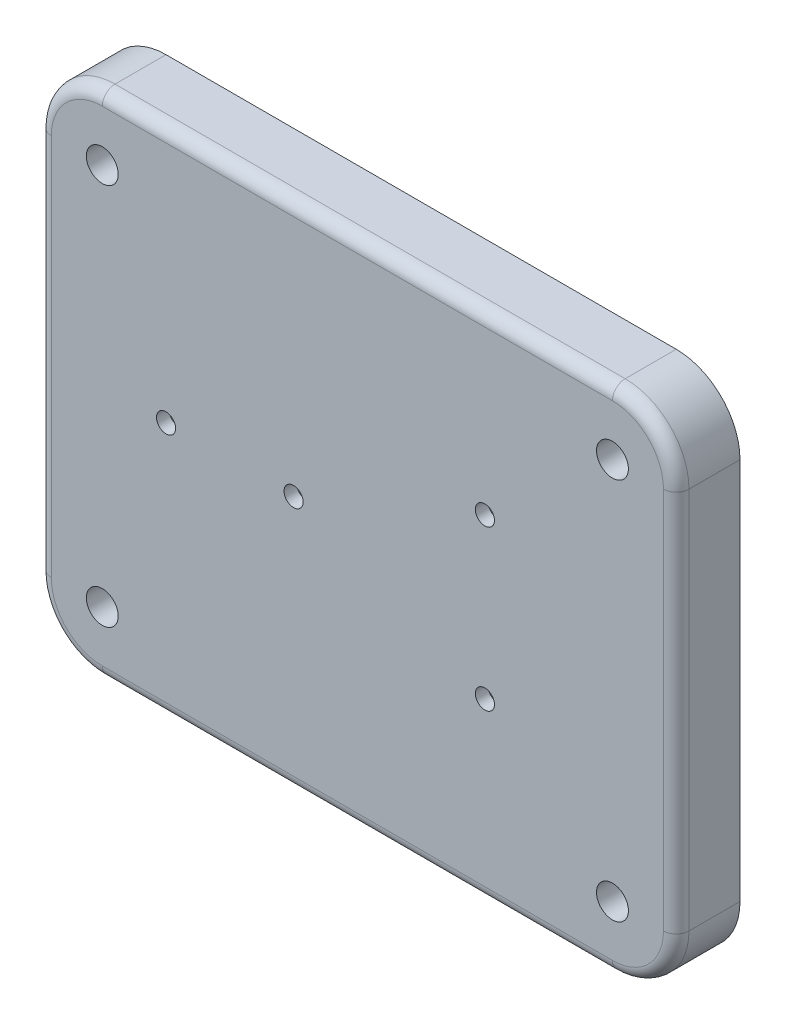
ISO-10303-21;
HEADER;
FILE_DESCRIPTION(('STEP AP214'),'2;1');
FILE_NAME('part.step','',(''),(''),'','','');
FILE_SCHEMA(('AUTOMOTIVE_DESIGN { 1 0 10303 214 1 1 1 1 }'));
ENDSEC;
DATA;
#1=APPLICATION_CONTEXT('core data for automotive mechanical design processes');
#2=APPLICATION_PROTOCOL_DEFINITION('international standard','automotive_design',2000,#1);
#3=PRODUCT_CONTEXT('',#1,'mechanical');
#4=PRODUCT('Part','Part','',(#3));
#5=PRODUCT_RELATED_PRODUCT_CATEGORY('part','',(#4));
#6=PRODUCT_DEFINITION_FORMATION('','',#4);
#7=PRODUCT_DEFINITION_CONTEXT('part definition',#1,'design');
#8=PRODUCT_DEFINITION('design','',#6,#7);
#9=PRODUCT_DEFINITION_SHAPE('','',#8);
#10=(LENGTH_UNIT() NAMED_UNIT(*) SI_UNIT(.MILLI.,.METRE.));
#11=(NAMED_UNIT(*) PLANE_ANGLE_UNIT() SI_UNIT($,.RADIAN.));
#12=(NAMED_UNIT(*) SI_UNIT($,.STERADIAN.) SOLID_ANGLE_UNIT());
#13=UNCERTAINTY_MEASURE_WITH_UNIT(LENGTH_MEASURE(1.E-05),#10,'distance_accuracy_value','');
#14=(GEOMETRIC_REPRESENTATION_CONTEXT(3) GLOBAL_UNCERTAINTY_ASSIGNED_CONTEXT((#13)) GLOBAL_UNIT_ASSIGNED_CONTEXT((#10,
#11,#12)) REPRESENTATION_CONTEXT('',''));
#15=CARTESIAN_POINT('',(0.,0.,0.));
#16=DIRECTION('',(0.,0.,1.));
#17=DIRECTION('',(1.,0.,0.));
#18=AXIS2_PLACEMENT_3D('',#15,#16,#17);
#19=CARTESIAN_POINT('',(0.,0.,0.));
#20=DIRECTION('',(0.,0.,1.));
#21=DIRECTION('',(1.,0.,0.));
#22=AXIS2_PLACEMENT_3D('',#19,#20,#21);
#23=PLANE('',#22);
#24=CARTESIAN_POINT('',(-40.,-30.,0.));
#25=DIRECTION('',(0.,0.,-1.));
#26=DIRECTION('',(-1.,0.,0.));
#27=AXIS2_PLACEMENT_3D('',#24,#25,#26);
#28=CIRCLE('',#27,2.5);
#29=CARTESIAN_POINT('',(-42.5,-30.,0.));
#30=VERTEX_POINT('',#29);
#31=EDGE_CURVE('E308',#30,#30,#28,.T.);
#32=ORIENTED_EDGE('',*,*,#31,.F.);
#33=EDGE_LOOP('',(#32));
#34=FACE_BOUND('',#33,.T.);
#35=CARTESIAN_POINT('',(-40.,-30.,0.));
#36=DIRECTION('',(0.,0.,1.));
#37=DIRECTION('',(1.,0.,0.));
#38=AXIS2_PLACEMENT_3D('',#35,#36,#37);
#39=CIRCLE('',#38,4.5);
#40=CARTESIAN_POINT('',(-35.5,-30.,0.));
#41=VERTEX_POINT('',#40);
#42=EDGE_CURVE('E239',#41,#41,#39,.F.);
#43=ORIENTED_EDGE('',*,*,#42,.T.);
#44=EDGE_LOOP('',(#43));
#45=FACE_BOUND('',#44,.T.);
#46=ADVANCED_FACE('F39',(#34,#45),#23,.F.);
#47=CARTESIAN_POINT('',(40.,30.,0.));
#48=DIRECTION('',(0.,0.,-1.));
#49=DIRECTION('',(1.,0.,0.));
#50=AXIS2_PLACEMENT_3D('',#47,#48,#49);
#51=CIRCLE('',#50,2.5);
#52=CARTESIAN_POINT('',(42.5,30.,0.));
#53=VERTEX_POINT('',#52);
#54=EDGE_CURVE('E326',#53,#53,#51,.T.);
#55=ORIENTED_EDGE('',*,*,#54,.F.);
#56=EDGE_LOOP('',(#55));
#57=FACE_BOUND('',#56,.T.);
#58=CARTESIAN_POINT('',(40.,30.,0.));
#59=DIRECTION('',(0.,0.,1.));
#60=DIRECTION('',(1.,0.,0.));
#61=AXIS2_PLACEMENT_3D('',#58,#59,#60);
#62=CIRCLE('',#61,4.5);
#63=CARTESIAN_POINT('',(44.5,30.,0.));
#64=VERTEX_POINT('',#63);
#65=EDGE_CURVE('E249',#64,#64,#62,.F.);
#66=ORIENTED_EDGE('',*,*,#65,.T.);
#67=EDGE_LOOP('',(#66));
#68=FACE_BOUND('',#67,.T.);
#69=ADVANCED_FACE('F501',(#57,#68),#23,.F.);
#70=CARTESIAN_POINT('',(-40.,30.,0.));
#71=DIRECTION('',(0.,0.,1.));
#72=DIRECTION('',(1.,0.,0.));
#73=AXIS2_PLACEMENT_3D('',#70,#71,#72);
#74=CIRCLE('',#73,4.5);
#75=CARTESIAN_POINT('',(-35.5,30.,0.));
#76=VERTEX_POINT('',#75);
#77=EDGE_CURVE('E244',#76,#76,#74,.T.);
#78=ORIENTED_EDGE('',*,*,#77,.F.);
#79=EDGE_LOOP('',(#78));
#80=FACE_BOUND('',#79,.T.);
#81=CARTESIAN_POINT('',(-40.,30.,0.));
#82=DIRECTION('',(0.,0.,1.));
#83=DIRECTION('',(-1.,0.,0.));
#84=AXIS2_PLACEMENT_3D('',#81,#82,#83);
#85=CIRCLE('',#84,2.5);
#86=CARTESIAN_POINT('',(-42.5,30.,0.));
#87=VERTEX_POINT('',#86);
#88=EDGE_CURVE('E318',#87,#87,#85,.T.);
#89=ORIENTED_EDGE('',*,*,#88,.T.);
#90=EDGE_LOOP('',(#89));
#91=FACE_BOUND('',#90,.T.);
#92=ADVANCED_FACE('F508',(#80,#91),#23,.F.);
#93=DIRECTION('',(0.,-1.,0.));
#94=VECTOR('',#93,1.);
#95=CARTESIAN_POINT('',(-50.,-40.,0.));
#96=LINE('',#95,#94);
#97=CARTESIAN_POINT('',(-50.,30.,0.));
#98=VERTEX_POINT('',#97);
#99=CARTESIAN_POINT('',(-50.,-30.,0.));
#100=VERTEX_POINT('',#99);
#101=EDGE_CURVE('E338',#98,#100,#96,.T.);
#102=ORIENTED_EDGE('',*,*,#101,.F.);
#103=CARTESIAN_POINT('',(-40.,30.,0.));
#104=DIRECTION('',(0.,0.,1.));
#105=DIRECTION('',(1.,0.,0.));
#106=AXIS2_PLACEMENT_3D('',#103,#104,#105);
#107=CIRCLE('',#106,10.);
#108=CARTESIAN_POINT('',(-40.,40.,0.));
#109=VERTEX_POINT('',#108);
#110=EDGE_CURVE('E373',#98,#109,#107,.F.);
#111=ORIENTED_EDGE('',*,*,#110,.T.);
#112=DIRECTION('',(-1.,0.,0.));
#113=VECTOR('',#112,1.);
#114=CARTESIAN_POINT('',(50.,40.,0.));
#115=LINE('',#114,#113);
#116=CARTESIAN_POINT('',(40.,40.,0.));
#117=VERTEX_POINT('',#116);
#118=EDGE_CURVE('E353',#117,#109,#115,.T.);
#119=ORIENTED_EDGE('',*,*,#118,.F.);
#120=CARTESIAN_POINT('',(40.,30.,0.));
#121=DIRECTION('',(0.,0.,1.));
#122=DIRECTION('',(1.,0.,0.));
#123=AXIS2_PLACEMENT_3D('',#120,#121,#122);
#124=CIRCLE('',#123,10.);
#125=CARTESIAN_POINT('',(50.,30.,0.));
#126=VERTEX_POINT('',#125);
#127=EDGE_CURVE('E364',#117,#126,#124,.F.);
#128=ORIENTED_EDGE('',*,*,#127,.T.);
#129=DIRECTION('',(0.,1.,0.));
#130=VECTOR('',#129,1.);
#131=CARTESIAN_POINT('',(50.,-40.,0.));
#132=LINE('',#131,#130);
#133=CARTESIAN_POINT('',(50.,-30.,0.));
#134=VERTEX_POINT('',#133);
#135=EDGE_CURVE('E349',#134,#126,#132,.T.);
#136=ORIENTED_EDGE('',*,*,#135,.F.);
#137=CARTESIAN_POINT('',(40.,-30.,0.));
#138=DIRECTION('',(0.,0.,1.));
#139=DIRECTION('',(1.,0.,0.));
#140=AXIS2_PLACEMENT_3D('',#137,#138,#139);
#141=CIRCLE('',#140,10.);
#142=CARTESIAN_POINT('',(40.,-40.,0.));
#143=VERTEX_POINT('',#142);
#144=EDGE_CURVE('E367',#134,#143,#141,.F.);
#145=ORIENTED_EDGE('',*,*,#144,.T.);
#146=DIRECTION('',(1.,0.,0.));
#147=VECTOR('',#146,1.);
#148=CARTESIAN_POINT('',(50.,-40.,0.));
#149=LINE('',#148,#147);
#150=CARTESIAN_POINT('',(-40.,-40.,0.));
#151=VERTEX_POINT('',#150);
#152=EDGE_CURVE('E345',#151,#143,#149,.T.);
#153=ORIENTED_EDGE('',*,*,#152,.F.);
#154=CARTESIAN_POINT('',(-40.,-30.,0.));
#155=DIRECTION('',(0.,0.,1.));
#156=DIRECTION('',(1.,0.,0.));
#157=AXIS2_PLACEMENT_3D('',#154,#155,#156);
#158=CIRCLE('',#157,10.);
#159=EDGE_CURVE('E370',#151,#100,#158,.F.);
#160=ORIENTED_EDGE('',*,*,#159,.T.);
#161=EDGE_LOOP('',(#102,#111,#119,#128,#136,#145,#153,#160));
#162=FACE_BOUND('',#161,.T.);
#163=CARTESIAN_POINT('',(-40.,30.,0.));
#164=DIRECTION('',(0.,0.,1.));
#165=DIRECTION('',(1.,0.,0.));
#166=AXIS2_PLACEMENT_3D('',#163,#164,#165);
#167=CIRCLE('',#166,8.);
#168=CARTESIAN_POINT('',(-48.,30.,0.));
#169=VERTEX_POINT('',#168);
#170=CARTESIAN_POINT('',(-40.,38.,0.));
#171=VERTEX_POINT('',#170);
#172=EDGE_CURVE('E272',#169,#171,#167,.F.);
#173=ORIENTED_EDGE('',*,*,#172,.F.);
#174=DIRECTION('',(0.,-1.,0.));
#175=VECTOR('',#174,1.);
#176=CARTESIAN_POINT('',(-48.,-40.,0.));
#177=LINE('',#176,#175);
#178=CARTESIAN_POINT('',(-48.,-30.,0.));
#179=VERTEX_POINT('',#178);
#180=EDGE_CURVE('E275',#169,#179,#177,.T.);
#181=ORIENTED_EDGE('',*,*,#180,.T.);
#182=CARTESIAN_POINT('',(-40.,-30.,0.));
#183=DIRECTION('',(0.,0.,1.));
#184=DIRECTION('',(1.,0.,0.));
#185=AXIS2_PLACEMENT_3D('',#182,#183,#184);
#186=CIRCLE('',#185,8.);
#187=CARTESIAN_POINT('',(-40.,-38.,0.));
#188=VERTEX_POINT('',#187);
#189=EDGE_CURVE('E186',#188,#179,#186,.F.);
#190=ORIENTED_EDGE('',*,*,#189,.F.);
#191=DIRECTION('',(1.,0.,0.));
#192=VECTOR('',#191,1.);
#193=CARTESIAN_POINT('',(50.,-38.,0.));
#194=LINE('',#193,#192);
#195=CARTESIAN_POINT('',(40.,-38.,0.));
#196=VERTEX_POINT('',#195);
#197=EDGE_CURVE('E57',#188,#196,#194,.T.);
#198=ORIENTED_EDGE('',*,*,#197,.T.);
#199=CARTESIAN_POINT('',(40.,-30.,0.));
#200=DIRECTION('',(0.,0.,1.));
#201=DIRECTION('',(1.,0.,0.));
#202=AXIS2_PLACEMENT_3D('',#199,#200,#201);
#203=CIRCLE('',#202,8.);
#204=CARTESIAN_POINT('',(48.,-30.,0.));
#205=VERTEX_POINT('',#204);
#206=EDGE_CURVE('E286',#205,#196,#203,.F.);
#207=ORIENTED_EDGE('',*,*,#206,.F.);
#208=DIRECTION('',(0.,1.,0.));
#209=VECTOR('',#208,1.);
#210=CARTESIAN_POINT('',(48.,-40.,0.));
#211=LINE('',#210,#209);
#212=CARTESIAN_POINT('',(48.,30.,0.));
#213=VERTEX_POINT('',#212);
#214=EDGE_CURVE('E283',#205,#213,#211,.T.);
#215=ORIENTED_EDGE('',*,*,#214,.T.);
#216=CARTESIAN_POINT('',(40.,30.,0.));
#217=DIRECTION('',(0.,0.,1.));
#218=DIRECTION('',(1.,0.,0.));
#219=AXIS2_PLACEMENT_3D('',#216,#217,#218);
#220=CIRCLE('',#219,8.);
#221=CARTESIAN_POINT('',(40.,38.,0.));
#222=VERTEX_POINT('',#221);
#223=EDGE_CURVE('E217',#222,#213,#220,.F.);
#224=ORIENTED_EDGE('',*,*,#223,.F.);
#225=DIRECTION('',(-1.,0.,0.));
#226=VECTOR('',#225,1.);
#227=CARTESIAN_POINT('',(50.,38.,0.));
#228=LINE('',#227,#226);
#229=EDGE_CURVE('E193',#222,#171,#228,.T.);
#230=ORIENTED_EDGE('',*,*,#229,.T.);
#231=EDGE_LOOP('',(#173,#181,#190,#198,#207,#215,#224,#230));
#232=FACE_BOUND('',#231,.T.);
#233=ADVANCED_FACE('F518',(#162,#232),#23,.F.);
#234=CARTESIAN_POINT('',(-50.,-40.,10.));
#235=DIRECTION('',(1.,0.,0.));
#236=DIRECTION('',(0.,0.,-1.));
#237=AXIS2_PLACEMENT_3D('',#234,#235,#236);
#238=PLANE('',#237);
#239=DIRECTION('',(0.,0.,-1.));
#240=VECTOR('',#239,1.);
#241=CARTESIAN_POINT('',(-50.,-30.,10.));
#242=LINE('',#241,#240);
#243=CARTESIAN_POINT('',(-50.,-30.,8.));
#244=VERTEX_POINT('',#243);
#245=EDGE_CURVE('E357',#100,#244,#242,.F.);
#246=ORIENTED_EDGE('',*,*,#245,.T.);
#247=DIRECTION('',(0.,-1.,0.));
#248=VECTOR('',#247,1.);
#249=CARTESIAN_POINT('',(-50.,30.,8.));
#250=LINE('',#249,#248);
#251=CARTESIAN_POINT('',(-50.,30.,8.));
#252=VERTEX_POINT('',#251);
#253=EDGE_CURVE('E425',#244,#252,#250,.F.);
#254=ORIENTED_EDGE('',*,*,#253,.T.);
#255=DIRECTION('',(0.,0.,-1.));
#256=VECTOR('',#255,1.);
#257=CARTESIAN_POINT('',(-50.,30.,10.));
#258=LINE('',#257,#256);
#259=EDGE_CURVE('E361',#252,#98,#258,.T.);
#260=ORIENTED_EDGE('',*,*,#259,.T.);
#261=ORIENTED_EDGE('',*,*,#101,.T.);
#262=EDGE_LOOP('',(#246,#254,#260,#261));
#263=FACE_BOUND('',#262,.T.);
#264=ADVANCED_FACE('F531',(#263),#238,.F.);
#265=CARTESIAN_POINT('',(50.,-40.,10.));
#266=DIRECTION('',(0.,1.,0.));
#267=DIRECTION('',(-1.,0.,0.));
#268=AXIS2_PLACEMENT_3D('',#265,#266,#267);
#269=PLANE('',#268);
#270=DIRECTION('',(0.,0.,-1.));
#271=VECTOR('',#270,1.);
#272=CARTESIAN_POINT('',(40.,-40.,10.));
#273=LINE('',#272,#271);
#274=CARTESIAN_POINT('',(40.,-40.,8.));
#275=VERTEX_POINT('',#274);
#276=EDGE_CURVE('E383',#143,#275,#273,.F.);
#277=ORIENTED_EDGE('',*,*,#276,.T.);
#278=DIRECTION('',(1.,0.,0.));
#279=VECTOR('',#278,1.);
#280=CARTESIAN_POINT('',(-40.,-40.,8.));
#281=LINE('',#280,#279);
#282=CARTESIAN_POINT('',(-40.,-40.,8.));
#283=VERTEX_POINT('',#282);
#284=EDGE_CURVE('E11',#275,#283,#281,.F.);
#285=ORIENTED_EDGE('',*,*,#284,.T.);
#286=DIRECTION('',(0.,0.,-1.));
#287=VECTOR('',#286,1.);
#288=CARTESIAN_POINT('',(-40.,-40.,10.));
#289=LINE('',#288,#287);
#290=EDGE_CURVE('E386',#283,#151,#289,.T.);
#291=ORIENTED_EDGE('',*,*,#290,.T.);
#292=ORIENTED_EDGE('',*,*,#152,.T.);
#293=EDGE_LOOP('',(#277,#285,#291,#292));
#294=FACE_BOUND('',#293,.T.);
#295=ADVANCED_FACE('F537',(#294),#269,.F.);
#296=CARTESIAN_POINT('',(50.,-40.,10.));
#297=DIRECTION('',(-1.,0.,0.));
#298=DIRECTION('',(0.,0.,1.));
#299=AXIS2_PLACEMENT_3D('',#296,#297,#298);
#300=PLANE('',#299);
#301=DIRECTION('',(0.,0.,-1.));
#302=VECTOR('',#301,1.);
#303=CARTESIAN_POINT('',(50.,30.,10.));
#304=LINE('',#303,#302);
#305=CARTESIAN_POINT('',(50.,30.,8.));
#306=VERTEX_POINT('',#305);
#307=EDGE_CURVE('E389',#126,#306,#304,.F.);
#308=ORIENTED_EDGE('',*,*,#307,.T.);
#309=DIRECTION('',(0.,1.,0.));
#310=VECTOR('',#309,1.);
#311=CARTESIAN_POINT('',(50.,-30.,8.));
#312=LINE('',#311,#310);
#313=CARTESIAN_POINT('',(50.,-30.,8.));
#314=VERTEX_POINT('',#313);
#315=EDGE_CURVE('E437',#306,#314,#312,.F.);
#316=ORIENTED_EDGE('',*,*,#315,.T.);
#317=DIRECTION('',(0.,0.,-1.));
#318=VECTOR('',#317,1.);
#319=CARTESIAN_POINT('',(50.,-30.,10.));
#320=LINE('',#319,#318);
#321=EDGE_CURVE('E393',#314,#134,#320,.T.);
#322=ORIENTED_EDGE('',*,*,#321,.T.);
#323=ORIENTED_EDGE('',*,*,#135,.T.);
#324=EDGE_LOOP('',(#308,#316,#322,#323));
#325=FACE_BOUND('',#324,.T.);
#326=ADVANCED_FACE('F678',(#325),#300,.F.);
#327=CARTESIAN_POINT('',(50.,40.,10.));
#328=DIRECTION('',(0.,-1.,0.));
#329=DIRECTION('',(1.,0.,0.));
#330=AXIS2_PLACEMENT_3D('',#327,#328,#329);
#331=PLANE('',#330);
#332=DIRECTION('',(0.,0.,-1.));
#333=VECTOR('',#332,1.);
#334=CARTESIAN_POINT('',(-40.,40.,10.));
#335=LINE('',#334,#333);
#336=CARTESIAN_POINT('',(-40.,40.,8.));
#337=VERTEX_POINT('',#336);
#338=EDGE_CURVE('E379',#109,#337,#335,.F.);
#339=ORIENTED_EDGE('',*,*,#338,.T.);
#340=DIRECTION('',(-1.,0.,0.));
#341=VECTOR('',#340,1.);
#342=CARTESIAN_POINT('',(40.,40.,8.));
#343=LINE('',#342,#341);
#344=CARTESIAN_POINT('',(40.,40.,8.));
#345=VERTEX_POINT('',#344);
#346=EDGE_CURVE('E431',#337,#345,#343,.F.);
#347=ORIENTED_EDGE('',*,*,#346,.T.);
#348=DIRECTION('',(0.,0.,-1.));
#349=VECTOR('',#348,1.);
#350=CARTESIAN_POINT('',(40.,40.,10.));
#351=LINE('',#350,#349);
#352=EDGE_CURVE('E376',#345,#117,#351,.T.);
#353=ORIENTED_EDGE('',*,*,#352,.T.);
#354=ORIENTED_EDGE('',*,*,#118,.T.);
#355=EDGE_LOOP('',(#339,#347,#353,#354));
#356=FACE_BOUND('',#355,.T.);
#357=ADVANCED_FACE('F526',(#356),#331,.F.);
#358=CARTESIAN_POINT('',(0.,0.,10.));
#359=DIRECTION('',(0.,0.,1.));
#360=DIRECTION('',(1.,0.,0.));
#361=AXIS2_PLACEMENT_3D('',#358,#359,#360);
#362=PLANE('',#361);
#363=CARTESIAN_POINT('',(-30.,0.,10.));
#364=DIRECTION('',(0.,0.,1.));
#365=DIRECTION('',(1.,0.,0.));
#366=AXIS2_PLACEMENT_3D('',#363,#364,#365);
#367=CIRCLE('',#366,1.5);
#368=CARTESIAN_POINT('',(-28.5,0.,10.));
#369=VERTEX_POINT('',#368);
#370=EDGE_CURVE('E475',#369,#369,#367,.T.);
#371=ORIENTED_EDGE('',*,*,#370,.F.);
#372=EDGE_LOOP('',(#371));
#373=FACE_BOUND('',#372,.T.);
#374=CARTESIAN_POINT('',(-10.,0.,10.));
#375=DIRECTION('',(0.,0.,1.));
#376=DIRECTION('',(1.,0.,0.));
#377=AXIS2_PLACEMENT_3D('',#374,#375,#376);
#378=CIRCLE('',#377,1.5);
#379=CARTESIAN_POINT('',(-8.5,0.,10.));
#380=VERTEX_POINT('',#379);
#381=EDGE_CURVE('E781',#380,#380,#378,.T.);
#382=ORIENTED_EDGE('',*,*,#381,.F.);
#383=EDGE_LOOP('',(#382));
#384=FACE_BOUND('',#383,.T.);
#385=CARTESIAN_POINT('',(20.,12.5,10.));
#386=DIRECTION('',(0.,0.,1.));
#387=DIRECTION('',(1.,0.,0.));
#388=AXIS2_PLACEMENT_3D('',#385,#386,#387);
#389=CIRCLE('',#388,1.5);
#390=CARTESIAN_POINT('',(21.5,12.5,10.));
#391=VERTEX_POINT('',#390);
#392=EDGE_CURVE('E773',#391,#391,#389,.T.);
#393=ORIENTED_EDGE('',*,*,#392,.F.);
#394=EDGE_LOOP('',(#393));
#395=FACE_BOUND('',#394,.T.);
#396=CARTESIAN_POINT('',(20.,-12.5,10.));
#397=DIRECTION('',(0.,0.,1.));
#398=DIRECTION('',(1.,0.,0.));
#399=AXIS2_PLACEMENT_3D('',#396,#397,#398);
#400=CIRCLE('',#399,1.5);
#401=CARTESIAN_POINT('',(21.5,-12.5,10.));
#402=VERTEX_POINT('',#401);
#403=EDGE_CURVE('E782',#402,#402,#400,.T.);
#404=ORIENTED_EDGE('',*,*,#403,.F.);
#405=EDGE_LOOP('',(#404));
#406=FACE_BOUND('',#405,.T.);
#407=DIRECTION('',(0.,-1.,0.));
#408=VECTOR('',#407,1.);
#409=CARTESIAN_POINT('',(-48.,-30.,10.));
#410=LINE('',#409,#408);
#411=CARTESIAN_POINT('',(-48.,30.,10.));
#412=VERTEX_POINT('',#411);
#413=CARTESIAN_POINT('',(-48.,-30.,10.));
#414=VERTEX_POINT('',#413);
#415=EDGE_CURVE('E414',#412,#414,#410,.T.);
#416=ORIENTED_EDGE('',*,*,#415,.T.);
#417=CARTESIAN_POINT('',(-40.,-30.,10.));
#418=DIRECTION('',(0.,0.,1.));
#419=DIRECTION('',(1.,0.,0.));
#420=AXIS2_PLACEMENT_3D('',#417,#418,#419);
#421=CIRCLE('',#420,8.);
#422=CARTESIAN_POINT('',(-40.,-38.,10.));
#423=VERTEX_POINT('',#422);
#424=EDGE_CURVE('E417',#414,#423,#421,.T.);
#425=ORIENTED_EDGE('',*,*,#424,.T.);
#426=DIRECTION('',(1.,0.,0.));
#427=VECTOR('',#426,1.);
#428=CARTESIAN_POINT('',(40.,-38.,10.));
#429=LINE('',#428,#427);
#430=CARTESIAN_POINT('',(40.,-38.,10.));
#431=VERTEX_POINT('',#430);
#432=EDGE_CURVE('E396',#423,#431,#429,.T.);
#433=ORIENTED_EDGE('',*,*,#432,.T.);
#434=CARTESIAN_POINT('',(40.,-30.,10.));
#435=DIRECTION('',(0.,0.,1.));
#436=DIRECTION('',(1.,0.,0.));
#437=AXIS2_PLACEMENT_3D('',#434,#435,#436);
#438=CIRCLE('',#437,8.);
#439=CARTESIAN_POINT('',(48.,-30.,10.));
#440=VERTEX_POINT('',#439);
#441=EDGE_CURVE('E399',#431,#440,#438,.T.);
#442=ORIENTED_EDGE('',*,*,#441,.T.);
#443=DIRECTION('',(0.,1.,0.));
#444=VECTOR('',#443,1.);
#445=CARTESIAN_POINT('',(48.,30.,10.));
#446=LINE('',#445,#444);
#447=CARTESIAN_POINT('',(48.,30.,10.));
#448=VERTEX_POINT('',#447);
#449=EDGE_CURVE('E402',#440,#448,#446,.T.);
#450=ORIENTED_EDGE('',*,*,#449,.T.);
#451=CARTESIAN_POINT('',(40.,30.,10.));
#452=DIRECTION('',(0.,0.,1.));
#453=DIRECTION('',(1.,0.,0.));
#454=AXIS2_PLACEMENT_3D('',#451,#452,#453);
#455=CIRCLE('',#454,8.);
#456=CARTESIAN_POINT('',(40.,38.,10.));
#457=VERTEX_POINT('',#456);
#458=EDGE_CURVE('E405',#448,#457,#455,.T.);
#459=ORIENTED_EDGE('',*,*,#458,.T.);
#460=DIRECTION('',(-1.,0.,0.));
#461=VECTOR('',#460,1.);
#462=CARTESIAN_POINT('',(-40.,38.,10.));
#463=LINE('',#462,#461);
#464=CARTESIAN_POINT('',(-40.,38.,10.));
#465=VERTEX_POINT('',#464);
#466=EDGE_CURVE('E408',#457,#465,#463,.T.);
#467=ORIENTED_EDGE('',*,*,#466,.T.);
#468=CARTESIAN_POINT('',(-40.,30.,10.));
#469=DIRECTION('',(0.,0.,1.));
#470=DIRECTION('',(1.,0.,0.));
#471=AXIS2_PLACEMENT_3D('',#468,#469,#470);
#472=CIRCLE('',#471,8.);
#473=EDGE_CURVE('E411',#465,#412,#472,.T.);
#474=ORIENTED_EDGE('',*,*,#473,.T.);
#475=EDGE_LOOP('',(#416,#425,#433,#442,#450,#459,#467,#474));
#476=FACE_BOUND('',#475,.T.);
#477=CARTESIAN_POINT('',(-40.,-30.,10.));
#478=DIRECTION('',(0.,0.,-1.));
#479=DIRECTION('',(-1.,0.,0.));
#480=AXIS2_PLACEMENT_3D('',#477,#478,#479);
#481=CIRCLE('',#480,2.5);
#482=CARTESIAN_POINT('',(-42.5,-30.,10.));
#483=VERTEX_POINT('',#482);
#484=EDGE_CURVE('E313',#483,#483,#481,.T.);
#485=ORIENTED_EDGE('',*,*,#484,.T.);
#486=EDGE_LOOP('',(#485));
#487=FACE_BOUND('',#486,.T.);
#488=CARTESIAN_POINT('',(-40.,30.,10.));
#489=DIRECTION('',(0.,0.,1.));
#490=DIRECTION('',(-1.,0.,0.));
#491=AXIS2_PLACEMENT_3D('',#488,#489,#490);
#492=CIRCLE('',#491,2.5);
#493=CARTESIAN_POINT('',(-42.5,30.,10.));
#494=VERTEX_POINT('',#493);
#495=EDGE_CURVE('E312',#494,#494,#492,.T.);
#496=ORIENTED_EDGE('',*,*,#495,.F.);
#497=EDGE_LOOP('',(#496));
#498=FACE_BOUND('',#497,.T.);
#499=CARTESIAN_POINT('',(40.,30.,10.));
#500=DIRECTION('',(0.,0.,-1.));
#501=DIRECTION('',(1.,0.,0.));
#502=AXIS2_PLACEMENT_3D('',#499,#500,#501);
#503=CIRCLE('',#502,2.5);
#504=CARTESIAN_POINT('',(42.5,30.,10.));
#505=VERTEX_POINT('',#504);
#506=EDGE_CURVE('E322',#505,#505,#503,.T.);
#507=ORIENTED_EDGE('',*,*,#506,.T.);
#508=EDGE_LOOP('',(#507));
#509=FACE_BOUND('',#508,.T.);
#510=CARTESIAN_POINT('',(40.,-30.,10.));
#511=DIRECTION('',(0.,0.,1.));
#512=DIRECTION('',(1.,0.,0.));
#513=AXIS2_PLACEMENT_3D('',#510,#511,#512);
#514=CIRCLE('',#513,2.5);
#515=CARTESIAN_POINT('',(42.5,-30.,10.));
#516=VERTEX_POINT('',#515);
#517=EDGE_CURVE('E330',#516,#516,#514,.T.);
#518=ORIENTED_EDGE('',*,*,#517,.F.);
#519=EDGE_LOOP('',(#518));
#520=FACE_BOUND('',#519,.T.);
#521=ADVANCED_FACE('F516',(#373,#384,#395,#406,#476,#487,#498,#509,#520),#362,.T.);
#522=CARTESIAN_POINT('',(40.,-30.,0.));
#523=DIRECTION('',(0.,0.,1.));
#524=DIRECTION('',(1.,0.,0.));
#525=AXIS2_PLACEMENT_3D('',#522,#523,#524);
#526=CIRCLE('',#525,4.5);
#527=CARTESIAN_POINT('',(44.5,-30.,0.));
#528=VERTEX_POINT('',#527);
#529=EDGE_CURVE('E254',#528,#528,#526,.T.);
#530=ORIENTED_EDGE('',*,*,#529,.F.);
#531=EDGE_LOOP('',(#530));
#532=FACE_BOUND('',#531,.T.);
#533=CARTESIAN_POINT('',(40.,-30.,0.));
#534=DIRECTION('',(0.,0.,1.));
#535=DIRECTION('',(1.,0.,0.));
#536=AXIS2_PLACEMENT_3D('',#533,#534,#535);
#537=CIRCLE('',#536,2.5);
#538=CARTESIAN_POINT('',(42.5,-30.,0.));
#539=VERTEX_POINT('',#538);
#540=EDGE_CURVE('E334',#539,#539,#537,.T.);
#541=ORIENTED_EDGE('',*,*,#540,.T.);
#542=EDGE_LOOP('',(#541));
#543=FACE_BOUND('',#542,.T.);
#544=ADVANCED_FACE('F504',(#532,#543),#23,.F.);
#545=CARTESIAN_POINT('',(-40.,30.,10.));
#546=DIRECTION('',(0.,0.,-1.));
#547=DIRECTION('',(-1.,0.,0.));
#548=AXIS2_PLACEMENT_3D('',#545,#546,#547);
#549=CYLINDRICAL_SURFACE('',#548,10.);
#550=ORIENTED_EDGE('',*,*,#259,.F.);
#551=CARTESIAN_POINT('',(-40.,30.,8.));
#552=DIRECTION('',(0.,0.,1.));
#553=DIRECTION('',(1.,0.,0.));
#554=AXIS2_PLACEMENT_3D('',#551,#552,#553);
#555=CIRCLE('',#554,10.);
#556=EDGE_CURVE('E428',#252,#337,#555,.F.);
#557=ORIENTED_EDGE('',*,*,#556,.T.);
#558=ORIENTED_EDGE('',*,*,#338,.F.);
#559=ORIENTED_EDGE('',*,*,#110,.F.);
#560=EDGE_LOOP('',(#550,#557,#558,#559));
#561=FACE_BOUND('',#560,.T.);
#562=ADVANCED_FACE('F515',(#561),#549,.T.);
#563=CARTESIAN_POINT('',(-40.,-30.,10.));
#564=DIRECTION('',(0.,0.,-1.));
#565=DIRECTION('',(-1.,0.,0.));
#566=AXIS2_PLACEMENT_3D('',#563,#564,#565);
#567=CYLINDRICAL_SURFACE('',#566,10.);
#568=ORIENTED_EDGE('',*,*,#290,.F.);
#569=CARTESIAN_POINT('',(-40.,-30.,8.));
#570=DIRECTION('',(0.,0.,1.));
#571=DIRECTION('',(1.,0.,0.));
#572=AXIS2_PLACEMENT_3D('',#569,#570,#571);
#573=CIRCLE('',#572,10.);
#574=EDGE_CURVE('E421',#283,#244,#573,.F.);
#575=ORIENTED_EDGE('',*,*,#574,.T.);
#576=ORIENTED_EDGE('',*,*,#245,.F.);
#577=ORIENTED_EDGE('',*,*,#159,.F.);
#578=EDGE_LOOP('',(#568,#575,#576,#577));
#579=FACE_BOUND('',#578,.T.);
#580=ADVANCED_FACE('F523',(#579),#567,.T.);
#581=CARTESIAN_POINT('',(40.,-30.,10.));
#582=DIRECTION('',(0.,0.,-1.));
#583=DIRECTION('',(-1.,0.,0.));
#584=AXIS2_PLACEMENT_3D('',#581,#582,#583);
#585=CYLINDRICAL_SURFACE('',#584,10.);
#586=ORIENTED_EDGE('',*,*,#321,.F.);
#587=CARTESIAN_POINT('',(40.,-30.,8.));
#588=DIRECTION('',(0.,0.,1.));
#589=DIRECTION('',(1.,0.,0.));
#590=AXIS2_PLACEMENT_3D('',#587,#588,#589);
#591=CIRCLE('',#590,10.);
#592=EDGE_CURVE('E49',#314,#275,#591,.F.);
#593=ORIENTED_EDGE('',*,*,#592,.T.);
#594=ORIENTED_EDGE('',*,*,#276,.F.);
#595=ORIENTED_EDGE('',*,*,#144,.F.);
#596=EDGE_LOOP('',(#586,#593,#594,#595));
#597=FACE_BOUND('',#596,.T.);
#598=ADVANCED_FACE('F624',(#597),#585,.T.);
#599=CARTESIAN_POINT('',(40.,30.,10.));
#600=DIRECTION('',(0.,0.,-1.));
#601=DIRECTION('',(-1.,0.,0.));
#602=AXIS2_PLACEMENT_3D('',#599,#600,#601);
#603=CYLINDRICAL_SURFACE('',#602,10.);
#604=ORIENTED_EDGE('',*,*,#352,.F.);
#605=CARTESIAN_POINT('',(40.,30.,8.));
#606=DIRECTION('',(0.,0.,1.));
#607=DIRECTION('',(1.,0.,0.));
#608=AXIS2_PLACEMENT_3D('',#605,#606,#607);
#609=CIRCLE('',#608,10.);
#610=EDGE_CURVE('E434',#345,#306,#609,.F.);
#611=ORIENTED_EDGE('',*,*,#610,.T.);
#612=ORIENTED_EDGE('',*,*,#307,.F.);
#613=ORIENTED_EDGE('',*,*,#127,.F.);
#614=EDGE_LOOP('',(#604,#611,#612,#613));
#615=FACE_BOUND('',#614,.T.);
#616=ADVANCED_FACE('F619',(#615),#603,.T.);
#617=CARTESIAN_POINT('',(40.,-30.,0.));
#618=DIRECTION('',(0.,0.,1.));
#619=DIRECTION('',(1.,0.,0.));
#620=AXIS2_PLACEMENT_3D('',#617,#618,#619);
#621=CYLINDRICAL_SURFACE('',#620,2.5);
#622=ORIENTED_EDGE('',*,*,#540,.F.);
#623=EDGE_LOOP('',(#622));
#624=FACE_BOUND('',#623,.T.);
#625=ORIENTED_EDGE('',*,*,#517,.T.);
#626=EDGE_LOOP('',(#625));
#627=FACE_BOUND('',#626,.T.);
#628=ADVANCED_FACE('F616',(#624,#627),#621,.F.);
#629=CARTESIAN_POINT('',(40.,30.,0.));
#630=DIRECTION('',(0.,0.,1.));
#631=DIRECTION('',(1.,0.,0.));
#632=AXIS2_PLACEMENT_3D('',#629,#630,#631);
#633=CYLINDRICAL_SURFACE('',#632,2.5);
#634=ORIENTED_EDGE('',*,*,#54,.T.);
#635=EDGE_LOOP('',(#634));
#636=FACE_BOUND('',#635,.T.);
#637=ORIENTED_EDGE('',*,*,#506,.F.);
#638=EDGE_LOOP('',(#637));
#639=FACE_BOUND('',#638,.T.);
#640=ADVANCED_FACE('F612',(#636,#639),#633,.F.);
#641=CARTESIAN_POINT('',(-40.,30.,0.));
#642=DIRECTION('',(0.,0.,1.));
#643=DIRECTION('',(1.,0.,0.));
#644=AXIS2_PLACEMENT_3D('',#641,#642,#643);
#645=CYLINDRICAL_SURFACE('',#644,2.5);
#646=ORIENTED_EDGE('',*,*,#88,.F.);
#647=EDGE_LOOP('',(#646));
#648=FACE_BOUND('',#647,.T.);
#649=ORIENTED_EDGE('',*,*,#495,.T.);
#650=EDGE_LOOP('',(#649));
#651=FACE_BOUND('',#650,.T.);
#652=ADVANCED_FACE('F608',(#648,#651),#645,.F.);
#653=CARTESIAN_POINT('',(-40.,-30.,0.));
#654=DIRECTION('',(0.,0.,1.));
#655=DIRECTION('',(1.,0.,0.));
#656=AXIS2_PLACEMENT_3D('',#653,#654,#655);
#657=CYLINDRICAL_SURFACE('',#656,2.5);
#658=ORIENTED_EDGE('',*,*,#31,.T.);
#659=EDGE_LOOP('',(#658));
#660=FACE_BOUND('',#659,.T.);
#661=ORIENTED_EDGE('',*,*,#484,.F.);
#662=EDGE_LOOP('',(#661));
#663=FACE_BOUND('',#662,.T.);
#664=ADVANCED_FACE('F605',(#660,#663),#657,.F.);
#665=CARTESIAN_POINT('',(40.,30.,8.));
#666=DIRECTION('',(0.,0.,1.));
#667=DIRECTION('',(1.,0.,0.));
#668=AXIS2_PLACEMENT_3D('',#665,#666,#667);
#669=TOROIDAL_SURFACE('',#668,8.,2.);
#670=CARTESIAN_POINT('',(48.,30.,8.));
#671=DIRECTION('',(0.,-1.,0.));
#672=DIRECTION('',(0.,0.,-1.));
#673=AXIS2_PLACEMENT_3D('',#670,#671,#672);
#674=CIRCLE('',#673,2.);
#675=EDGE_CURVE('E463',#306,#448,#674,.T.);
#676=ORIENTED_EDGE('',*,*,#675,.F.);
#677=ORIENTED_EDGE('',*,*,#610,.F.);
#678=CARTESIAN_POINT('',(40.,38.,8.));
#679=DIRECTION('',(-1.,0.,0.));
#680=DIRECTION('',(0.,0.,1.));
#681=AXIS2_PLACEMENT_3D('',#678,#679,#680);
#682=CIRCLE('',#681,2.);
#683=EDGE_CURVE('E317',#457,#345,#682,.T.);
#684=ORIENTED_EDGE('',*,*,#683,.F.);
#685=ORIENTED_EDGE('',*,*,#458,.F.);
#686=EDGE_LOOP('',(#676,#677,#684,#685));
#687=FACE_BOUND('',#686,.T.);
#688=ADVANCED_FACE('F41',(#687),#669,.T.);
#689=CARTESIAN_POINT('',(0.,38.,8.));
#690=DIRECTION('',(1.,0.,0.));
#691=DIRECTION('',(0.,1.,0.));
#692=AXIS2_PLACEMENT_3D('',#689,#690,#691);
#693=CYLINDRICAL_SURFACE('',#692,2.);
#694=ORIENTED_EDGE('',*,*,#683,.T.);
#695=ORIENTED_EDGE('',*,*,#346,.F.);
#696=CARTESIAN_POINT('',(-40.,38.,8.));
#697=DIRECTION('',(-1.,0.,0.));
#698=DIRECTION('',(0.,0.,1.));
#699=AXIS2_PLACEMENT_3D('',#696,#697,#698);
#700=CIRCLE('',#699,2.);
#701=EDGE_CURVE('E459',#465,#337,#700,.T.);
#702=ORIENTED_EDGE('',*,*,#701,.F.);
#703=ORIENTED_EDGE('',*,*,#466,.F.);
#704=EDGE_LOOP('',(#694,#695,#702,#703));
#705=FACE_BOUND('',#704,.T.);
#706=ADVANCED_FACE('F659',(#705),#693,.T.);
#707=CARTESIAN_POINT('',(48.,0.,8.));
#708=DIRECTION('',(0.,-1.,0.));
#709=DIRECTION('',(0.,0.,-1.));
#710=AXIS2_PLACEMENT_3D('',#707,#708,#709);
#711=CYLINDRICAL_SURFACE('',#710,2.);
#712=ORIENTED_EDGE('',*,*,#675,.T.);
#713=ORIENTED_EDGE('',*,*,#449,.F.);
#714=CARTESIAN_POINT('',(48.,-30.,8.));
#715=DIRECTION('',(0.,-1.,0.));
#716=DIRECTION('',(0.,0.,-1.));
#717=AXIS2_PLACEMENT_3D('',#714,#715,#716);
#718=CIRCLE('',#717,2.);
#719=EDGE_CURVE('E455',#314,#440,#718,.T.);
#720=ORIENTED_EDGE('',*,*,#719,.F.);
#721=ORIENTED_EDGE('',*,*,#315,.F.);
#722=EDGE_LOOP('',(#712,#713,#720,#721));
#723=FACE_BOUND('',#722,.T.);
#724=ADVANCED_FACE('F656',(#723),#711,.T.);
#725=CARTESIAN_POINT('',(-40.,30.,8.));
#726=DIRECTION('',(0.,0.,1.));
#727=DIRECTION('',(1.,0.,0.));
#728=AXIS2_PLACEMENT_3D('',#725,#726,#727);
#729=TOROIDAL_SURFACE('',#728,8.,2.);
#730=ORIENTED_EDGE('',*,*,#701,.T.);
#731=ORIENTED_EDGE('',*,*,#556,.F.);
#732=CARTESIAN_POINT('',(-48.,30.,8.));
#733=DIRECTION('',(0.,-1.,0.));
#734=DIRECTION('',(0.,0.,-1.));
#735=AXIS2_PLACEMENT_3D('',#732,#733,#734);
#736=CIRCLE('',#735,2.);
#737=EDGE_CURVE('E451',#412,#252,#736,.T.);
#738=ORIENTED_EDGE('',*,*,#737,.F.);
#739=ORIENTED_EDGE('',*,*,#473,.F.);
#740=EDGE_LOOP('',(#730,#731,#738,#739));
#741=FACE_BOUND('',#740,.T.);
#742=ADVANCED_FACE('F652',(#741),#729,.T.);
#743=CARTESIAN_POINT('',(40.,-30.,8.));
#744=DIRECTION('',(0.,0.,1.));
#745=DIRECTION('',(1.,0.,0.));
#746=AXIS2_PLACEMENT_3D('',#743,#744,#745);
#747=TOROIDAL_SURFACE('',#746,8.,2.);
#748=ORIENTED_EDGE('',*,*,#719,.T.);
#749=ORIENTED_EDGE('',*,*,#441,.F.);
#750=CARTESIAN_POINT('',(40.,-38.,8.));
#751=DIRECTION('',(-1.,0.,0.));
#752=DIRECTION('',(0.,0.,1.));
#753=AXIS2_PLACEMENT_3D('',#750,#751,#752);
#754=CIRCLE('',#753,2.);
#755=EDGE_CURVE('E447',#275,#431,#754,.T.);
#756=ORIENTED_EDGE('',*,*,#755,.F.);
#757=ORIENTED_EDGE('',*,*,#592,.F.);
#758=EDGE_LOOP('',(#748,#749,#756,#757));
#759=FACE_BOUND('',#758,.T.);
#760=ADVANCED_FACE('F648',(#759),#747,.T.);
#761=CARTESIAN_POINT('',(-48.,0.,8.));
#762=DIRECTION('',(0.,1.,0.));
#763=DIRECTION('',(0.,0.,1.));
#764=AXIS2_PLACEMENT_3D('',#761,#762,#763);
#765=CYLINDRICAL_SURFACE('',#764,2.);
#766=ORIENTED_EDGE('',*,*,#737,.T.);
#767=ORIENTED_EDGE('',*,*,#253,.F.);
#768=CARTESIAN_POINT('',(-48.,-30.,8.));
#769=DIRECTION('',(0.,-1.,0.));
#770=DIRECTION('',(0.,0.,-1.));
#771=AXIS2_PLACEMENT_3D('',#768,#769,#770);
#772=CIRCLE('',#771,2.);
#773=EDGE_CURVE('E444',#414,#244,#772,.T.);
#774=ORIENTED_EDGE('',*,*,#773,.F.);
#775=ORIENTED_EDGE('',*,*,#415,.F.);
#776=EDGE_LOOP('',(#766,#767,#774,#775));
#777=FACE_BOUND('',#776,.T.);
#778=ADVANCED_FACE('F644',(#777),#765,.T.);
#779=CARTESIAN_POINT('',(0.,-38.,8.));
#780=DIRECTION('',(-1.,0.,0.));
#781=DIRECTION('',(0.,-1.,0.));
#782=AXIS2_PLACEMENT_3D('',#779,#780,#781);
#783=CYLINDRICAL_SURFACE('',#782,2.);
#784=ORIENTED_EDGE('',*,*,#755,.T.);
#785=ORIENTED_EDGE('',*,*,#432,.F.);
#786=CARTESIAN_POINT('',(-40.,-38.,8.));
#787=DIRECTION('',(-1.,0.,0.));
#788=DIRECTION('',(0.,0.,1.));
#789=AXIS2_PLACEMENT_3D('',#786,#787,#788);
#790=CIRCLE('',#789,2.);
#791=EDGE_CURVE('E231',#283,#423,#790,.T.);
#792=ORIENTED_EDGE('',*,*,#791,.F.);
#793=ORIENTED_EDGE('',*,*,#284,.F.);
#794=EDGE_LOOP('',(#784,#785,#792,#793));
#795=FACE_BOUND('',#794,.T.);
#796=ADVANCED_FACE('F640',(#795),#783,.T.);
#797=CARTESIAN_POINT('',(-40.,-30.,8.));
#798=DIRECTION('',(0.,0.,1.));
#799=DIRECTION('',(1.,0.,0.));
#800=AXIS2_PLACEMENT_3D('',#797,#798,#799);
#801=TOROIDAL_SURFACE('',#800,8.,2.);
#802=ORIENTED_EDGE('',*,*,#773,.T.);
#803=ORIENTED_EDGE('',*,*,#574,.F.);
#804=ORIENTED_EDGE('',*,*,#791,.T.);
#805=ORIENTED_EDGE('',*,*,#424,.F.);
#806=EDGE_LOOP('',(#802,#803,#804,#805));
#807=FACE_BOUND('',#806,.T.);
#808=ADVANCED_FACE('F572',(#807),#801,.T.);
#809=CARTESIAN_POINT('',(-48.,-40.,10.));
#810=DIRECTION('',(1.,0.,0.));
#811=DIRECTION('',(0.,0.,-1.));
#812=AXIS2_PLACEMENT_3D('',#809,#810,#811);
#813=PLANE('',#812);
#814=DIRECTION('',(0.,0.,-1.));
#815=VECTOR('',#814,1.);
#816=CARTESIAN_POINT('',(-48.,-30.,10.));
#817=LINE('',#816,#815);
#818=CARTESIAN_POINT('',(-48.,-30.,8.));
#819=VERTEX_POINT('',#818);
#820=EDGE_CURVE('E180',#179,#819,#817,.F.);
#821=ORIENTED_EDGE('',*,*,#820,.F.);
#822=ORIENTED_EDGE('',*,*,#180,.F.);
#823=DIRECTION('',(0.,0.,-1.));
#824=VECTOR('',#823,1.);
#825=CARTESIAN_POINT('',(-48.,30.,10.));
#826=LINE('',#825,#824);
#827=CARTESIAN_POINT('',(-48.,30.,8.));
#828=VERTEX_POINT('',#827);
#829=EDGE_CURVE('E192',#828,#169,#826,.T.);
#830=ORIENTED_EDGE('',*,*,#829,.F.);
#831=DIRECTION('',(0.,1.,0.));
#832=VECTOR('',#831,1.);
#833=CARTESIAN_POINT('',(-48.,0.,8.));
#834=LINE('',#833,#832);
#835=EDGE_CURVE('E200',#819,#828,#834,.T.);
#836=ORIENTED_EDGE('',*,*,#835,.F.);
#837=EDGE_LOOP('',(#821,#822,#830,#836));
#838=FACE_BOUND('',#837,.T.);
#839=ADVANCED_FACE('F207',(#838),#813,.T.);
#840=CARTESIAN_POINT('',(50.,-38.,10.));
#841=DIRECTION('',(0.,1.,0.));
#842=DIRECTION('',(-1.,0.,0.));
#843=AXIS2_PLACEMENT_3D('',#840,#841,#842);
#844=PLANE('',#843);
#845=DIRECTION('',(0.,0.,1.));
#846=VECTOR('',#845,1.);
#847=CARTESIAN_POINT('',(40.,-38.,10.));
#848=LINE('',#847,#846);
#849=CARTESIAN_POINT('',(40.,-38.,8.));
#850=VERTEX_POINT('',#849);
#851=EDGE_CURVE('E255',#196,#850,#848,.T.);
#852=ORIENTED_EDGE('',*,*,#851,.F.);
#853=ORIENTED_EDGE('',*,*,#197,.F.);
#854=DIRECTION('',(0.,0.,1.));
#855=VECTOR('',#854,1.);
#856=CARTESIAN_POINT('',(-40.,-38.,10.));
#857=LINE('',#856,#855);
#858=CARTESIAN_POINT('',(-40.,-38.,8.));
#859=VERTEX_POINT('',#858);
#860=EDGE_CURVE('E259',#859,#188,#857,.F.);
#861=ORIENTED_EDGE('',*,*,#860,.F.);
#862=DIRECTION('',(1.,0.,0.));
#863=VECTOR('',#862,1.);
#864=CARTESIAN_POINT('',(50.,-38.,8.));
#865=LINE('',#864,#863);
#866=EDGE_CURVE('E203',#859,#850,#865,.T.);
#867=ORIENTED_EDGE('',*,*,#866,.T.);
#868=EDGE_LOOP('',(#852,#853,#861,#867));
#869=FACE_BOUND('',#868,.T.);
#870=ADVANCED_FACE('F564',(#869),#844,.T.);
#871=CARTESIAN_POINT('',(48.,-40.,10.));
#872=DIRECTION('',(-1.,0.,0.));
#873=DIRECTION('',(0.,0.,1.));
#874=AXIS2_PLACEMENT_3D('',#871,#872,#873);
#875=PLANE('',#874);
#876=DIRECTION('',(0.,0.,1.));
#877=VECTOR('',#876,1.);
#878=CARTESIAN_POINT('',(48.,30.,10.));
#879=LINE('',#878,#877);
#880=CARTESIAN_POINT('',(48.,30.,8.));
#881=VERTEX_POINT('',#880);
#882=EDGE_CURVE('E263',#213,#881,#879,.T.);
#883=ORIENTED_EDGE('',*,*,#882,.F.);
#884=ORIENTED_EDGE('',*,*,#214,.F.);
#885=DIRECTION('',(0.,0.,1.));
#886=VECTOR('',#885,1.);
#887=CARTESIAN_POINT('',(48.,-30.,10.));
#888=LINE('',#887,#886);
#889=CARTESIAN_POINT('',(48.,-30.,8.));
#890=VERTEX_POINT('',#889);
#891=EDGE_CURVE('E222',#890,#205,#888,.F.);
#892=ORIENTED_EDGE('',*,*,#891,.F.);
#893=DIRECTION('',(0.,1.,0.));
#894=VECTOR('',#893,1.);
#895=CARTESIAN_POINT('',(48.,-40.,8.));
#896=LINE('',#895,#894);
#897=EDGE_CURVE('E205',#890,#881,#896,.T.);
#898=ORIENTED_EDGE('',*,*,#897,.T.);
#899=EDGE_LOOP('',(#883,#884,#892,#898));
#900=FACE_BOUND('',#899,.T.);
#901=ADVANCED_FACE('F559',(#900),#875,.T.);
#902=CARTESIAN_POINT('',(50.,38.,10.));
#903=DIRECTION('',(0.,-1.,0.));
#904=DIRECTION('',(1.,0.,0.));
#905=AXIS2_PLACEMENT_3D('',#902,#903,#904);
#906=PLANE('',#905);
#907=DIRECTION('',(0.,0.,1.));
#908=VECTOR('',#907,1.);
#909=CARTESIAN_POINT('',(-40.,38.,10.));
#910=LINE('',#909,#908);
#911=CARTESIAN_POINT('',(-40.,38.,8.));
#912=VERTEX_POINT('',#911);
#913=EDGE_CURVE('E260',#171,#912,#910,.T.);
#914=ORIENTED_EDGE('',*,*,#913,.F.);
#915=ORIENTED_EDGE('',*,*,#229,.F.);
#916=DIRECTION('',(0.,0.,1.));
#917=VECTOR('',#916,1.);
#918=CARTESIAN_POINT('',(40.,38.,10.));
#919=LINE('',#918,#917);
#920=CARTESIAN_POINT('',(40.,38.,8.));
#921=VERTEX_POINT('',#920);
#922=EDGE_CURVE('E269',#921,#222,#919,.F.);
#923=ORIENTED_EDGE('',*,*,#922,.F.);
#924=DIRECTION('',(1.,0.,0.));
#925=VECTOR('',#924,1.);
#926=CARTESIAN_POINT('',(0.,38.,8.));
#927=LINE('',#926,#925);
#928=EDGE_CURVE('E212',#912,#921,#927,.T.);
#929=ORIENTED_EDGE('',*,*,#928,.F.);
#930=EDGE_LOOP('',(#914,#915,#923,#929));
#931=FACE_BOUND('',#930,.T.);
#932=ADVANCED_FACE('F551',(#931),#906,.T.);
#933=CARTESIAN_POINT('',(0.,0.,8.));
#934=DIRECTION('',(0.,0.,1.));
#935=DIRECTION('',(1.,0.,0.));
#936=AXIS2_PLACEMENT_3D('',#933,#934,#935);
#937=PLANE('',#936);
#938=CARTESIAN_POINT('',(-30.,0.,8.));
#939=DIRECTION('',(0.,0.,1.));
#940=DIRECTION('',(1.,0.,0.));
#941=AXIS2_PLACEMENT_3D('',#938,#939,#940);
#942=CIRCLE('',#941,1.5);
#943=CARTESIAN_POINT('',(-28.5,0.,8.));
#944=VERTEX_POINT('',#943);
#945=EDGE_CURVE('E43',#944,#944,#942,.T.);
#946=ORIENTED_EDGE('',*,*,#945,.T.);
#947=EDGE_LOOP('',(#946));
#948=FACE_BOUND('',#947,.T.);
#949=CARTESIAN_POINT('',(-10.,0.,8.));
#950=DIRECTION('',(0.,0.,1.));
#951=DIRECTION('',(1.,0.,0.));
#952=AXIS2_PLACEMENT_3D('',#949,#950,#951);
#953=CIRCLE('',#952,1.5);
#954=CARTESIAN_POINT('',(-8.5,0.,8.));
#955=VERTEX_POINT('',#954);
#956=EDGE_CURVE('E478',#955,#955,#953,.T.);
#957=ORIENTED_EDGE('',*,*,#956,.T.);
#958=EDGE_LOOP('',(#957));
#959=FACE_BOUND('',#958,.T.);
#960=CARTESIAN_POINT('',(20.,12.5,8.));
#961=DIRECTION('',(0.,0.,1.));
#962=DIRECTION('',(1.,0.,0.));
#963=AXIS2_PLACEMENT_3D('',#960,#961,#962);
#964=CIRCLE('',#963,1.5);
#965=CARTESIAN_POINT('',(21.5,12.5,8.));
#966=VERTEX_POINT('',#965);
#967=EDGE_CURVE('E474',#966,#966,#964,.T.);
#968=ORIENTED_EDGE('',*,*,#967,.T.);
#969=EDGE_LOOP('',(#968));
#970=FACE_BOUND('',#969,.T.);
#971=CARTESIAN_POINT('',(20.,-12.5,8.));
#972=DIRECTION('',(0.,0.,1.));
#973=DIRECTION('',(1.,0.,0.));
#974=AXIS2_PLACEMENT_3D('',#971,#972,#973);
#975=CIRCLE('',#974,1.5);
#976=CARTESIAN_POINT('',(21.5,-12.5,8.));
#977=VERTEX_POINT('',#976);
#978=EDGE_CURVE('E470',#977,#977,#975,.T.);
#979=ORIENTED_EDGE('',*,*,#978,.T.);
#980=EDGE_LOOP('',(#979));
#981=FACE_BOUND('',#980,.T.);
#982=ORIENTED_EDGE('',*,*,#835,.T.);
#983=CARTESIAN_POINT('',(-40.,30.,8.));
#984=DIRECTION('',(0.,0.,1.));
#985=DIRECTION('',(1.,0.,0.));
#986=AXIS2_PLACEMENT_3D('',#983,#984,#985);
#987=CIRCLE('',#986,8.);
#988=EDGE_CURVE('E209',#828,#912,#987,.F.);
#989=ORIENTED_EDGE('',*,*,#988,.T.);
#990=ORIENTED_EDGE('',*,*,#928,.T.);
#991=CARTESIAN_POINT('',(40.,30.,8.));
#992=DIRECTION('',(0.,0.,1.));
#993=DIRECTION('',(1.,0.,0.));
#994=AXIS2_PLACEMENT_3D('',#991,#992,#993);
#995=CIRCLE('',#994,8.);
#996=EDGE_CURVE('E227',#921,#881,#995,.F.);
#997=ORIENTED_EDGE('',*,*,#996,.T.);
#998=ORIENTED_EDGE('',*,*,#897,.F.);
#999=CARTESIAN_POINT('',(40.,-30.,8.));
#1000=DIRECTION('',(0.,0.,1.));
#1001=DIRECTION('',(1.,0.,0.));
#1002=AXIS2_PLACEMENT_3D('',#999,#1000,#1001);
#1003=CIRCLE('',#1002,8.);
#1004=EDGE_CURVE('E221',#850,#890,#1003,.T.);
#1005=ORIENTED_EDGE('',*,*,#1004,.F.);
#1006=ORIENTED_EDGE('',*,*,#866,.F.);
#1007=CARTESIAN_POINT('',(-40.,-30.,8.));
#1008=DIRECTION('',(0.,0.,1.));
#1009=DIRECTION('',(1.,0.,0.));
#1010=AXIS2_PLACEMENT_3D('',#1007,#1008,#1009);
#1011=CIRCLE('',#1010,8.);
#1012=EDGE_CURVE('E183',#859,#819,#1011,.F.);
#1013=ORIENTED_EDGE('',*,*,#1012,.T.);
#1014=EDGE_LOOP('',(#982,#989,#990,#997,#998,#1005,#1006,#1013));
#1015=FACE_BOUND('',#1014,.T.);
#1016=CARTESIAN_POINT('',(-40.,-30.,8.));
#1017=DIRECTION('',(0.,0.,1.));
#1018=DIRECTION('',(1.,0.,0.));
#1019=AXIS2_PLACEMENT_3D('',#1016,#1017,#1018);
#1020=CIRCLE('',#1019,4.5);
#1021=CARTESIAN_POINT('',(-35.5,-30.,8.));
#1022=VERTEX_POINT('',#1021);
#1023=EDGE_CURVE('E235',#1022,#1022,#1020,.F.);
#1024=ORIENTED_EDGE('',*,*,#1023,.F.);
#1025=EDGE_LOOP('',(#1024));
#1026=FACE_BOUND('',#1025,.T.);
#1027=CARTESIAN_POINT('',(-40.,30.,8.));
#1028=DIRECTION('',(0.,0.,1.));
#1029=DIRECTION('',(1.,0.,0.));
#1030=AXIS2_PLACEMENT_3D('',#1027,#1028,#1029);
#1031=CIRCLE('',#1030,4.5);
#1032=CARTESIAN_POINT('',(-35.5,30.,8.));
#1033=VERTEX_POINT('',#1032);
#1034=EDGE_CURVE('E240',#1033,#1033,#1031,.T.);
#1035=ORIENTED_EDGE('',*,*,#1034,.T.);
#1036=EDGE_LOOP('',(#1035));
#1037=FACE_BOUND('',#1036,.T.);
#1038=CARTESIAN_POINT('',(40.,30.,8.));
#1039=DIRECTION('',(0.,0.,1.));
#1040=DIRECTION('',(1.,0.,0.));
#1041=AXIS2_PLACEMENT_3D('',#1038,#1039,#1040);
#1042=CIRCLE('',#1041,4.5);
#1043=CARTESIAN_POINT('',(44.5,30.,8.));
#1044=VERTEX_POINT('',#1043);
#1045=EDGE_CURVE('E245',#1044,#1044,#1042,.F.);
#1046=ORIENTED_EDGE('',*,*,#1045,.F.);
#1047=EDGE_LOOP('',(#1046));
#1048=FACE_BOUND('',#1047,.T.);
#1049=CARTESIAN_POINT('',(40.,-30.,8.));
#1050=DIRECTION('',(0.,0.,1.));
#1051=DIRECTION('',(1.,0.,0.));
#1052=AXIS2_PLACEMENT_3D('',#1049,#1050,#1051);
#1053=CIRCLE('',#1052,4.5);
#1054=CARTESIAN_POINT('',(44.5,-30.,8.));
#1055=VERTEX_POINT('',#1054);
#1056=EDGE_CURVE('E250',#1055,#1055,#1053,.T.);
#1057=ORIENTED_EDGE('',*,*,#1056,.T.);
#1058=EDGE_LOOP('',(#1057));
#1059=FACE_BOUND('',#1058,.T.);
#1060=ADVANCED_FACE('F197',(#948,#959,#970,#981,#1015,#1026,#1037,#1048,#1059),#937,.F.);
#1061=CARTESIAN_POINT('',(-40.,30.,10.));
#1062=DIRECTION('',(0.,0.,-1.));
#1063=DIRECTION('',(-1.,0.,0.));
#1064=AXIS2_PLACEMENT_3D('',#1061,#1062,#1063);
#1065=CYLINDRICAL_SURFACE('',#1064,8.);
#1066=ORIENTED_EDGE('',*,*,#829,.T.);
#1067=ORIENTED_EDGE('',*,*,#172,.T.);
#1068=ORIENTED_EDGE('',*,*,#913,.T.);
#1069=ORIENTED_EDGE('',*,*,#988,.F.);
#1070=EDGE_LOOP('',(#1066,#1067,#1068,#1069));
#1071=FACE_BOUND('',#1070,.T.);
#1072=ADVANCED_FACE('F548',(#1071),#1065,.F.);
#1073=CARTESIAN_POINT('',(-40.,-30.,10.));
#1074=DIRECTION('',(0.,0.,-1.));
#1075=DIRECTION('',(-1.,0.,0.));
#1076=AXIS2_PLACEMENT_3D('',#1073,#1074,#1075);
#1077=CYLINDRICAL_SURFACE('',#1076,8.);
#1078=ORIENTED_EDGE('',*,*,#860,.T.);
#1079=ORIENTED_EDGE('',*,*,#189,.T.);
#1080=ORIENTED_EDGE('',*,*,#820,.T.);
#1081=ORIENTED_EDGE('',*,*,#1012,.F.);
#1082=EDGE_LOOP('',(#1078,#1079,#1080,#1081));
#1083=FACE_BOUND('',#1082,.T.);
#1084=ADVANCED_FACE('F182',(#1083),#1077,.F.);
#1085=CARTESIAN_POINT('',(40.,-30.,10.));
#1086=DIRECTION('',(0.,0.,-1.));
#1087=DIRECTION('',(-1.,0.,0.));
#1088=AXIS2_PLACEMENT_3D('',#1085,#1086,#1087);
#1089=CYLINDRICAL_SURFACE('',#1088,8.);
#1090=ORIENTED_EDGE('',*,*,#891,.T.);
#1091=ORIENTED_EDGE('',*,*,#206,.T.);
#1092=ORIENTED_EDGE('',*,*,#851,.T.);
#1093=ORIENTED_EDGE('',*,*,#1004,.T.);
#1094=EDGE_LOOP('',(#1090,#1091,#1092,#1093));
#1095=FACE_BOUND('',#1094,.T.);
#1096=ADVANCED_FACE('F563',(#1095),#1089,.F.);
#1097=CARTESIAN_POINT('',(40.,30.,10.));
#1098=DIRECTION('',(0.,0.,-1.));
#1099=DIRECTION('',(-1.,0.,0.));
#1100=AXIS2_PLACEMENT_3D('',#1097,#1098,#1099);
#1101=CYLINDRICAL_SURFACE('',#1100,8.);
#1102=ORIENTED_EDGE('',*,*,#922,.T.);
#1103=ORIENTED_EDGE('',*,*,#223,.T.);
#1104=ORIENTED_EDGE('',*,*,#882,.T.);
#1105=ORIENTED_EDGE('',*,*,#996,.F.);
#1106=EDGE_LOOP('',(#1102,#1103,#1104,#1105));
#1107=FACE_BOUND('',#1106,.T.);
#1108=ADVANCED_FACE('F555',(#1107),#1101,.F.);
#1109=CARTESIAN_POINT('',(40.,-30.,0.));
#1110=DIRECTION('',(0.,0.,1.));
#1111=DIRECTION('',(1.,0.,0.));
#1112=AXIS2_PLACEMENT_3D('',#1109,#1110,#1111);
#1113=CYLINDRICAL_SURFACE('',#1112,4.5);
#1114=ORIENTED_EDGE('',*,*,#529,.T.);
#1115=EDGE_LOOP('',(#1114));
#1116=FACE_BOUND('',#1115,.T.);
#1117=ORIENTED_EDGE('',*,*,#1056,.F.);
#1118=EDGE_LOOP('',(#1117));
#1119=FACE_BOUND('',#1118,.T.);
#1120=ADVANCED_FACE('F588',(#1116,#1119),#1113,.T.);
#1121=CARTESIAN_POINT('',(40.,30.,0.));
#1122=DIRECTION('',(0.,0.,1.));
#1123=DIRECTION('',(1.,0.,0.));
#1124=AXIS2_PLACEMENT_3D('',#1121,#1122,#1123);
#1125=CYLINDRICAL_SURFACE('',#1124,4.5);
#1126=ORIENTED_EDGE('',*,*,#65,.F.);
#1127=EDGE_LOOP('',(#1126));
#1128=FACE_BOUND('',#1127,.T.);
#1129=ORIENTED_EDGE('',*,*,#1045,.T.);
#1130=EDGE_LOOP('',(#1129));
#1131=FACE_BOUND('',#1130,.T.);
#1132=ADVANCED_FACE('F591',(#1128,#1131),#1125,.T.);
#1133=CARTESIAN_POINT('',(-40.,30.,0.));
#1134=DIRECTION('',(0.,0.,1.));
#1135=DIRECTION('',(1.,0.,0.));
#1136=AXIS2_PLACEMENT_3D('',#1133,#1134,#1135);
#1137=CYLINDRICAL_SURFACE('',#1136,4.5);
#1138=ORIENTED_EDGE('',*,*,#77,.T.);
#1139=EDGE_LOOP('',(#1138));
#1140=FACE_BOUND('',#1139,.T.);
#1141=ORIENTED_EDGE('',*,*,#1034,.F.);
#1142=EDGE_LOOP('',(#1141));
#1143=FACE_BOUND('',#1142,.T.);
#1144=ADVANCED_FACE('F595',(#1140,#1143),#1137,.T.);
#1145=CARTESIAN_POINT('',(-40.,-30.,0.));
#1146=DIRECTION('',(0.,0.,1.));
#1147=DIRECTION('',(1.,0.,0.));
#1148=AXIS2_PLACEMENT_3D('',#1145,#1146,#1147);
#1149=CYLINDRICAL_SURFACE('',#1148,4.5);
#1150=ORIENTED_EDGE('',*,*,#42,.F.);
#1151=EDGE_LOOP('',(#1150));
#1152=FACE_BOUND('',#1151,.T.);
#1153=ORIENTED_EDGE('',*,*,#1023,.T.);
#1154=EDGE_LOOP('',(#1153));
#1155=FACE_BOUND('',#1154,.T.);
#1156=ADVANCED_FACE('F599',(#1152,#1155),#1149,.T.);
#1157=CARTESIAN_POINT('',(20.,-12.5,0.));
#1158=DIRECTION('',(0.,0.,1.));
#1159=DIRECTION('',(1.,0.,0.));
#1160=AXIS2_PLACEMENT_3D('',#1157,#1158,#1159);
#1161=CYLINDRICAL_SURFACE('',#1160,1.5);
#1162=ORIENTED_EDGE('',*,*,#403,.T.);
#1163=EDGE_LOOP('',(#1162));
#1164=FACE_BOUND('',#1163,.T.);
#1165=ORIENTED_EDGE('',*,*,#978,.F.);
#1166=EDGE_LOOP('',(#1165));
#1167=FACE_BOUND('',#1166,.T.);
#1168=ADVANCED_FACE('F603',(#1164,#1167),#1161,.F.);
#1169=CARTESIAN_POINT('',(20.,12.5,0.));
#1170=DIRECTION('',(0.,0.,1.));
#1171=DIRECTION('',(1.,0.,0.));
#1172=AXIS2_PLACEMENT_3D('',#1169,#1170,#1171);
#1173=CYLINDRICAL_SURFACE('',#1172,1.5);
#1174=ORIENTED_EDGE('',*,*,#392,.T.);
#1175=EDGE_LOOP('',(#1174));
#1176=FACE_BOUND('',#1175,.T.);
#1177=ORIENTED_EDGE('',*,*,#967,.F.);
#1178=EDGE_LOOP('',(#1177));
#1179=FACE_BOUND('',#1178,.T.);
#1180=ADVANCED_FACE('F496',(#1176,#1179),#1173,.F.);
#1181=CARTESIAN_POINT('',(-10.,0.,0.));
#1182=DIRECTION('',(0.,0.,1.));
#1183=DIRECTION('',(1.,0.,0.));
#1184=AXIS2_PLACEMENT_3D('',#1181,#1182,#1183);
#1185=CYLINDRICAL_SURFACE('',#1184,1.5);
#1186=ORIENTED_EDGE('',*,*,#381,.T.);
#1187=EDGE_LOOP('',(#1186));
#1188=FACE_BOUND('',#1187,.T.);
#1189=ORIENTED_EDGE('',*,*,#956,.F.);
#1190=EDGE_LOOP('',(#1189));
#1191=FACE_BOUND('',#1190,.T.);
#1192=ADVANCED_FACE('F490',(#1188,#1191),#1185,.F.);
#1193=CARTESIAN_POINT('',(-30.,0.,0.));
#1194=DIRECTION('',(0.,0.,1.));
#1195=DIRECTION('',(1.,0.,0.));
#1196=AXIS2_PLACEMENT_3D('',#1193,#1194,#1195);
#1197=CYLINDRICAL_SURFACE('',#1196,1.5);
#1198=ORIENTED_EDGE('',*,*,#370,.T.);
#1199=EDGE_LOOP('',(#1198));
#1200=FACE_BOUND('',#1199,.T.);
#1201=ORIENTED_EDGE('',*,*,#945,.F.);
#1202=EDGE_LOOP('',(#1201));
#1203=FACE_BOUND('',#1202,.T.);
#1204=ADVANCED_FACE('F488',(#1200,#1203),#1197,.F.);
#1205=CLOSED_SHELL('',(#46,#69,#92,#233,#264,#295,#326,#357,#521,#544,#562,#580,#598,#616,#628,
#640,#652,#664,#688,#706,#724,#742,#760,#778,#796,#808,#839,#870,#901,#932,#1060,#1072,#1084,
#1096,#1108,#1120,#1132,#1144,#1156,#1168,#1180,#1192,#1204));
#1206=MANIFOLD_SOLID_BREP('B2',#1205);
#1207=ADVANCED_BREP_SHAPE_REPRESENTATION('',(#18,#1206),#14);
#1208=SHAPE_DEFINITION_REPRESENTATION(#9,#1207);
ENDSEC;
END-ISO-10303-21;
